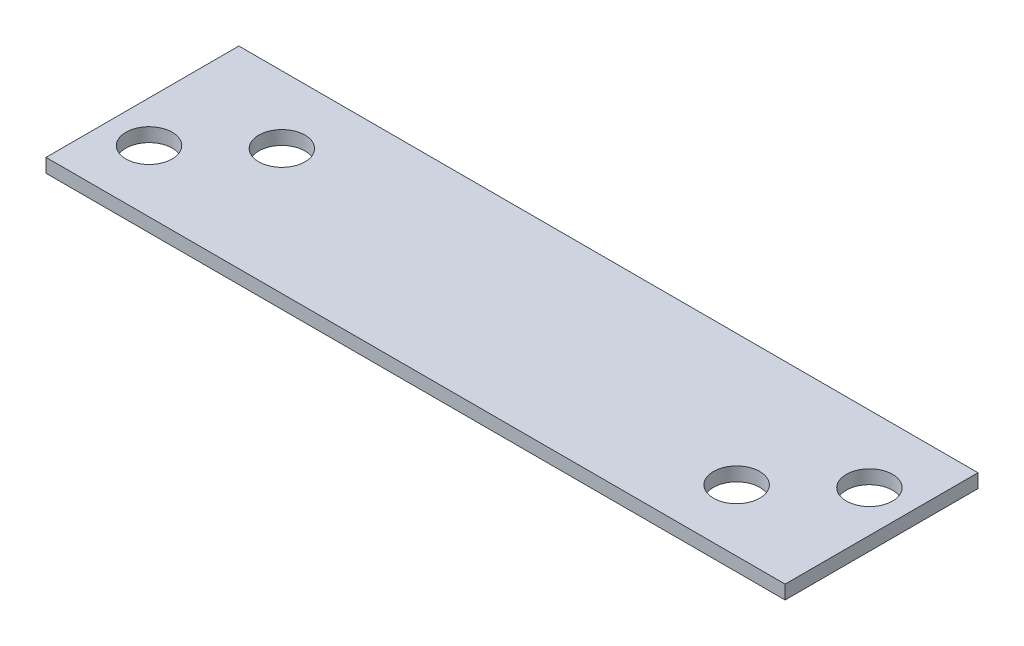
ISO-10303-21;
HEADER;
FILE_DESCRIPTION(('STEP AP214'),'2;1');
FILE_NAME('part.step','',(''),(''),'','','');
FILE_SCHEMA(('AUTOMOTIVE_DESIGN { 1 0 10303 214 1 1 1 1 }'));
ENDSEC;
DATA;
#1=APPLICATION_CONTEXT('core data for automotive mechanical design processes');
#2=APPLICATION_PROTOCOL_DEFINITION('international standard','automotive_design',2000,#1);
#3=PRODUCT_CONTEXT('',#1,'mechanical');
#4=PRODUCT('Part','Part','',(#3));
#5=PRODUCT_RELATED_PRODUCT_CATEGORY('part','',(#4));
#6=PRODUCT_DEFINITION_FORMATION('','',#4);
#7=PRODUCT_DEFINITION_CONTEXT('part definition',#1,'design');
#8=PRODUCT_DEFINITION('design','',#6,#7);
#9=PRODUCT_DEFINITION_SHAPE('','',#8);
#10=(LENGTH_UNIT() NAMED_UNIT(*) SI_UNIT(.MILLI.,.METRE.));
#11=(NAMED_UNIT(*) PLANE_ANGLE_UNIT() SI_UNIT($,.RADIAN.));
#12=(NAMED_UNIT(*) SI_UNIT($,.STERADIAN.) SOLID_ANGLE_UNIT());
#13=UNCERTAINTY_MEASURE_WITH_UNIT(LENGTH_MEASURE(1.E-05),#10,'distance_accuracy_value','');
#14=(GEOMETRIC_REPRESENTATION_CONTEXT(3) GLOBAL_UNCERTAINTY_ASSIGNED_CONTEXT((#13)) GLOBAL_UNIT_ASSIGNED_CONTEXT((#10,
#11,#12)) REPRESENTATION_CONTEXT('',''));
#15=CARTESIAN_POINT('',(0.,0.,0.));
#16=DIRECTION('',(0.,0.,1.));
#17=DIRECTION('',(1.,0.,0.));
#18=AXIS2_PLACEMENT_3D('',#15,#16,#17);
#19=CARTESIAN_POINT('',(0.,1.5875,0.));
#20=DIRECTION('',(1.,0.,0.));
#21=DIRECTION('',(0.,0.,-1.));
#22=AXIS2_PLACEMENT_3D('',#19,#20,#21);
#23=PLANE('',#22);
#24=DIRECTION('',(0.,0.,1.));
#25=VECTOR('',#24,1.);
#26=CARTESIAN_POINT('',(0.,0.,0.));
#27=LINE('',#26,#25);
#28=CARTESIAN_POINT('',(0.,0.,-22.225));
#29=VERTEX_POINT('',#28);
#30=CARTESIAN_POINT('',(0.,0.,0.));
#31=VERTEX_POINT('',#30);
#32=EDGE_CURVE('E109',#29,#31,#27,.T.);
#33=ORIENTED_EDGE('',*,*,#32,.T.);
#34=DIRECTION('',(0.,-1.,0.));
#35=VECTOR('',#34,1.);
#36=CARTESIAN_POINT('',(0.,1.5875,0.));
#37=LINE('',#36,#35);
#38=CARTESIAN_POINT('',(0.,1.5875,0.));
#39=VERTEX_POINT('',#38);
#40=EDGE_CURVE('E11',#39,#31,#37,.T.);
#41=ORIENTED_EDGE('',*,*,#40,.F.);
#42=DIRECTION('',(0.,0.,1.));
#43=VECTOR('',#42,1.);
#44=CARTESIAN_POINT('',(0.,1.5875,0.));
#45=LINE('',#44,#43);
#46=CARTESIAN_POINT('',(0.,1.5875,-22.225));
#47=VERTEX_POINT('',#46);
#48=EDGE_CURVE('E92',#47,#39,#45,.T.);
#49=ORIENTED_EDGE('',*,*,#48,.F.);
#50=DIRECTION('',(0.,-1.,0.));
#51=VECTOR('',#50,1.);
#52=CARTESIAN_POINT('',(0.,1.5875,-22.225));
#53=LINE('',#52,#51);
#54=EDGE_CURVE('E105',#47,#29,#53,.T.);
#55=ORIENTED_EDGE('',*,*,#54,.T.);
#56=EDGE_LOOP('',(#33,#41,#49,#55));
#57=FACE_BOUND('',#56,.T.);
#58=ADVANCED_FACE('F39',(#57),#23,.F.);
#59=CARTESIAN_POINT('',(0.,1.5875,0.));
#60=DIRECTION('',(0.,0.,-1.));
#61=DIRECTION('',(-1.,0.,0.));
#62=AXIS2_PLACEMENT_3D('',#59,#60,#61);
#63=PLANE('',#62);
#64=DIRECTION('',(1.,0.,0.));
#65=VECTOR('',#64,1.);
#66=CARTESIAN_POINT('',(0.,0.,0.));
#67=LINE('',#66,#65);
#68=CARTESIAN_POINT('',(85.1662,0.,0.));
#69=VERTEX_POINT('',#68);
#70=EDGE_CURVE('E97',#31,#69,#67,.T.);
#71=ORIENTED_EDGE('',*,*,#70,.T.);
#72=DIRECTION('',(0.,-1.,0.));
#73=VECTOR('',#72,1.);
#74=CARTESIAN_POINT('',(85.1662,1.5875,0.));
#75=LINE('',#74,#73);
#76=CARTESIAN_POINT('',(85.1662,1.5875,0.));
#77=VERTEX_POINT('',#76);
#78=EDGE_CURVE('E47',#77,#69,#75,.T.);
#79=ORIENTED_EDGE('',*,*,#78,.F.);
#80=DIRECTION('',(1.,0.,0.));
#81=VECTOR('',#80,1.);
#82=CARTESIAN_POINT('',(0.,1.5875,0.));
#83=LINE('',#82,#81);
#84=EDGE_CURVE('E87',#39,#77,#83,.T.);
#85=ORIENTED_EDGE('',*,*,#84,.F.);
#86=ORIENTED_EDGE('',*,*,#40,.T.);
#87=EDGE_LOOP('',(#71,#79,#85,#86));
#88=FACE_BOUND('',#87,.T.);
#89=ADVANCED_FACE('F96',(#88),#63,.F.);
#90=CARTESIAN_POINT('',(85.1662,1.5875,0.));
#91=DIRECTION('',(-1.,0.,0.));
#92=DIRECTION('',(0.,0.,1.));
#93=AXIS2_PLACEMENT_3D('',#90,#91,#92);
#94=PLANE('',#93);
#95=DIRECTION('',(0.,0.,-1.));
#96=VECTOR('',#95,1.);
#97=CARTESIAN_POINT('',(85.1662,0.,0.));
#98=LINE('',#97,#96);
#99=CARTESIAN_POINT('',(85.1662,0.,-22.225));
#100=VERTEX_POINT('',#99);
#101=EDGE_CURVE('E74',#69,#100,#98,.T.);
#102=ORIENTED_EDGE('',*,*,#101,.T.);
#103=DIRECTION('',(0.,-1.,0.));
#104=VECTOR('',#103,1.);
#105=CARTESIAN_POINT('',(85.1662,1.5875,-22.225));
#106=LINE('',#105,#104);
#107=CARTESIAN_POINT('',(85.1662,1.5875,-22.225));
#108=VERTEX_POINT('',#107);
#109=EDGE_CURVE('E98',#108,#100,#106,.T.);
#110=ORIENTED_EDGE('',*,*,#109,.F.);
#111=DIRECTION('',(0.,0.,-1.));
#112=VECTOR('',#111,1.);
#113=CARTESIAN_POINT('',(85.1662,1.5875,0.));
#114=LINE('',#113,#112);
#115=EDGE_CURVE('E90',#77,#108,#114,.T.);
#116=ORIENTED_EDGE('',*,*,#115,.F.);
#117=ORIENTED_EDGE('',*,*,#78,.T.);
#118=EDGE_LOOP('',(#102,#110,#116,#117));
#119=FACE_BOUND('',#118,.T.);
#120=ADVANCED_FACE('F99',(#119),#94,.F.);
#121=CARTESIAN_POINT('',(0.,1.5875,-22.225));
#122=DIRECTION('',(0.,0.,1.));
#123=DIRECTION('',(1.,0.,0.));
#124=AXIS2_PLACEMENT_3D('',#121,#122,#123);
#125=PLANE('',#124);
#126=DIRECTION('',(-1.,0.,0.));
#127=VECTOR('',#126,1.);
#128=CARTESIAN_POINT('',(0.,0.,-22.225));
#129=LINE('',#128,#127);
#130=EDGE_CURVE('E80',#100,#29,#129,.T.);
#131=ORIENTED_EDGE('',*,*,#130,.T.);
#132=ORIENTED_EDGE('',*,*,#54,.F.);
#133=DIRECTION('',(-1.,0.,0.));
#134=VECTOR('',#133,1.);
#135=CARTESIAN_POINT('',(0.,1.5875,-22.225));
#136=LINE('',#135,#134);
#137=EDGE_CURVE('E57',#108,#47,#136,.T.);
#138=ORIENTED_EDGE('',*,*,#137,.F.);
#139=ORIENTED_EDGE('',*,*,#109,.T.);
#140=EDGE_LOOP('',(#131,#132,#138,#139));
#141=FACE_BOUND('',#140,.T.);
#142=ADVANCED_FACE('F121',(#141),#125,.F.);
#143=CARTESIAN_POINT('',(0.,1.5875,0.));
#144=DIRECTION('',(0.,-1.,0.));
#145=DIRECTION('',(0.,0.,-1.));
#146=AXIS2_PLACEMENT_3D('',#143,#144,#145);
#147=PLANE('',#146);
#148=CARTESIAN_POINT('',(4.7625,1.5875,-7.11199999999479));
#149=DIRECTION('',(0.,-1.,0.));
#150=DIRECTION('',(0.,0.,-1.));
#151=AXIS2_PLACEMENT_3D('',#148,#149,#150);
#152=CIRCLE('',#151,2.667);
#153=CARTESIAN_POINT('',(4.7625,1.5875,-9.77899999999479));
#154=VERTEX_POINT('',#153);
#155=EDGE_CURVE('E113',#154,#154,#152,.F.);
#156=ORIENTED_EDGE('',*,*,#155,.F.);
#157=EDGE_LOOP('',(#156));
#158=FACE_BOUND('',#157,.T.);
#159=CARTESIAN_POINT('',(12.7,1.5875,-14.477999999996));
#160=DIRECTION('',(0.,-1.,0.));
#161=DIRECTION('',(0.,0.,-1.));
#162=AXIS2_PLACEMENT_3D('',#159,#160,#161);
#163=CIRCLE('',#162,2.667);
#164=CARTESIAN_POINT('',(12.7,1.5875,-17.144999999996));
#165=VERTEX_POINT('',#164);
#166=EDGE_CURVE('E144',#165,#165,#163,.F.);
#167=ORIENTED_EDGE('',*,*,#166,.F.);
#168=EDGE_LOOP('',(#167));
#169=FACE_BOUND('',#168,.T.);
#170=CARTESIAN_POINT('',(72.4662,1.5875,-7.11199999999657));
#171=DIRECTION('',(0.,-1.,0.));
#172=DIRECTION('',(0.,0.,-1.));
#173=AXIS2_PLACEMENT_3D('',#170,#171,#172);
#174=CIRCLE('',#173,2.667);
#175=CARTESIAN_POINT('',(72.4662,1.5875,-9.77899999999657));
#176=VERTEX_POINT('',#175);
#177=EDGE_CURVE('E136',#176,#176,#174,.F.);
#178=ORIENTED_EDGE('',*,*,#177,.F.);
#179=EDGE_LOOP('',(#178));
#180=FACE_BOUND('',#179,.T.);
#181=CARTESIAN_POINT('',(80.4037,1.5875,-14.4779999999966));
#182=DIRECTION('',(0.,-1.,0.));
#183=DIRECTION('',(0.,0.,-1.));
#184=AXIS2_PLACEMENT_3D('',#181,#182,#183);
#185=CIRCLE('',#184,2.66699999999999);
#186=CARTESIAN_POINT('',(80.4037,1.5875,-17.1449999999966));
#187=VERTEX_POINT('',#186);
#188=EDGE_CURVE('E128',#187,#187,#185,.F.);
#189=ORIENTED_EDGE('',*,*,#188,.F.);
#190=EDGE_LOOP('',(#189));
#191=FACE_BOUND('',#190,.T.);
#192=ORIENTED_EDGE('',*,*,#48,.T.);
#193=ORIENTED_EDGE('',*,*,#84,.T.);
#194=ORIENTED_EDGE('',*,*,#115,.T.);
#195=ORIENTED_EDGE('',*,*,#137,.T.);
#196=EDGE_LOOP('',(#192,#193,#194,#195));
#197=FACE_BOUND('',#196,.T.);
#198=ADVANCED_FACE('F88',(#158,#169,#180,#191,#197),#147,.F.);
#199=CARTESIAN_POINT('',(0.,0.,0.));
#200=DIRECTION('',(0.,-1.,0.));
#201=DIRECTION('',(0.,0.,-1.));
#202=AXIS2_PLACEMENT_3D('',#199,#200,#201);
#203=PLANE('',#202);
#204=CARTESIAN_POINT('',(4.7625,0.,-7.11199999999479));
#205=DIRECTION('',(0.,-1.,0.));
#206=DIRECTION('',(0.,0.,-1.));
#207=AXIS2_PLACEMENT_3D('',#204,#205,#206);
#208=CIRCLE('',#207,2.667);
#209=CARTESIAN_POINT('',(4.7625,0.,-9.77899999999479));
#210=VERTEX_POINT('',#209);
#211=EDGE_CURVE('E148',#210,#210,#208,.T.);
#212=ORIENTED_EDGE('',*,*,#211,.F.);
#213=EDGE_LOOP('',(#212));
#214=FACE_BOUND('',#213,.T.);
#215=CARTESIAN_POINT('',(12.7,0.,-14.477999999996));
#216=DIRECTION('',(0.,-1.,0.));
#217=DIRECTION('',(0.,0.,-1.));
#218=AXIS2_PLACEMENT_3D('',#215,#216,#217);
#219=CIRCLE('',#218,2.667);
#220=CARTESIAN_POINT('',(12.7,0.,-17.144999999996));
#221=VERTEX_POINT('',#220);
#222=EDGE_CURVE('E140',#221,#221,#219,.T.);
#223=ORIENTED_EDGE('',*,*,#222,.F.);
#224=EDGE_LOOP('',(#223));
#225=FACE_BOUND('',#224,.T.);
#226=CARTESIAN_POINT('',(72.4662,0.,-7.11199999999657));
#227=DIRECTION('',(0.,-1.,0.));
#228=DIRECTION('',(0.,0.,-1.));
#229=AXIS2_PLACEMENT_3D('',#226,#227,#228);
#230=CIRCLE('',#229,2.667);
#231=CARTESIAN_POINT('',(72.4662,0.,-9.77899999999657));
#232=VERTEX_POINT('',#231);
#233=EDGE_CURVE('E132',#232,#232,#230,.T.);
#234=ORIENTED_EDGE('',*,*,#233,.F.);
#235=EDGE_LOOP('',(#234));
#236=FACE_BOUND('',#235,.T.);
#237=CARTESIAN_POINT('',(80.4037,0.,-14.4779999999966));
#238=DIRECTION('',(0.,-1.,0.));
#239=DIRECTION('',(0.,0.,-1.));
#240=AXIS2_PLACEMENT_3D('',#237,#238,#239);
#241=CIRCLE('',#240,2.66699999999999);
#242=CARTESIAN_POINT('',(80.4037,0.,-17.1449999999966));
#243=VERTEX_POINT('',#242);
#244=EDGE_CURVE('E133',#243,#243,#241,.T.);
#245=ORIENTED_EDGE('',*,*,#244,.F.);
#246=EDGE_LOOP('',(#245));
#247=FACE_BOUND('',#246,.T.);
#248=ORIENTED_EDGE('',*,*,#32,.F.);
#249=ORIENTED_EDGE('',*,*,#130,.F.);
#250=ORIENTED_EDGE('',*,*,#101,.F.);
#251=ORIENTED_EDGE('',*,*,#70,.F.);
#252=EDGE_LOOP('',(#248,#249,#250,#251));
#253=FACE_BOUND('',#252,.T.);
#254=ADVANCED_FACE('F124',(#214,#225,#236,#247,#253),#203,.T.);
#255=CARTESIAN_POINT('',(80.4037,1.5885,-14.4779999999966));
#256=DIRECTION('',(0.,-1.,0.));
#257=DIRECTION('',(0.,0.,-1.));
#258=AXIS2_PLACEMENT_3D('',#255,#256,#257);
#259=CYLINDRICAL_SURFACE('',#258,2.66699999999999);
#260=ORIENTED_EDGE('',*,*,#244,.T.);
#261=EDGE_LOOP('',(#260));
#262=FACE_BOUND('',#261,.T.);
#263=ORIENTED_EDGE('',*,*,#188,.T.);
#264=EDGE_LOOP('',(#263));
#265=FACE_BOUND('',#264,.T.);
#266=ADVANCED_FACE('F162',(#262,#265),#259,.F.);
#267=CARTESIAN_POINT('',(72.4662,1.5885,-7.11199999999657));
#268=DIRECTION('',(0.,-1.,0.));
#269=DIRECTION('',(0.,0.,-1.));
#270=AXIS2_PLACEMENT_3D('',#267,#268,#269);
#271=CYLINDRICAL_SURFACE('',#270,2.667);
#272=ORIENTED_EDGE('',*,*,#233,.T.);
#273=EDGE_LOOP('',(#272));
#274=FACE_BOUND('',#273,.T.);
#275=ORIENTED_EDGE('',*,*,#177,.T.);
#276=EDGE_LOOP('',(#275));
#277=FACE_BOUND('',#276,.T.);
#278=ADVANCED_FACE('F172',(#274,#277),#271,.F.);
#279=CARTESIAN_POINT('',(12.7,1.5885,-14.477999999996));
#280=DIRECTION('',(0.,-1.,0.));
#281=DIRECTION('',(0.,0.,-1.));
#282=AXIS2_PLACEMENT_3D('',#279,#280,#281);
#283=CYLINDRICAL_SURFACE('',#282,2.667);
#284=ORIENTED_EDGE('',*,*,#222,.T.);
#285=EDGE_LOOP('',(#284));
#286=FACE_BOUND('',#285,.T.);
#287=ORIENTED_EDGE('',*,*,#166,.T.);
#288=EDGE_LOOP('',(#287));
#289=FACE_BOUND('',#288,.T.);
#290=ADVANCED_FACE('F222',(#286,#289),#283,.F.);
#291=CARTESIAN_POINT('',(4.7625,1.5885,-7.11199999999479));
#292=DIRECTION('',(0.,-1.,0.));
#293=DIRECTION('',(0.,0.,-1.));
#294=AXIS2_PLACEMENT_3D('',#291,#292,#293);
#295=CYLINDRICAL_SURFACE('',#294,2.667);
#296=ORIENTED_EDGE('',*,*,#211,.T.);
#297=EDGE_LOOP('',(#296));
#298=FACE_BOUND('',#297,.T.);
#299=ORIENTED_EDGE('',*,*,#155,.T.);
#300=EDGE_LOOP('',(#299));
#301=FACE_BOUND('',#300,.T.);
#302=ADVANCED_FACE('F157',(#298,#301),#295,.F.);
#303=CLOSED_SHELL('',(#58,#89,#120,#142,#198,#254,#266,#278,#290,#302));
#304=MANIFOLD_SOLID_BREP('B2',#303);
#305=ADVANCED_BREP_SHAPE_REPRESENTATION('',(#18,#304),#14);
#306=SHAPE_DEFINITION_REPRESENTATION(#9,#305);
ENDSEC;
END-ISO-10303-21;
